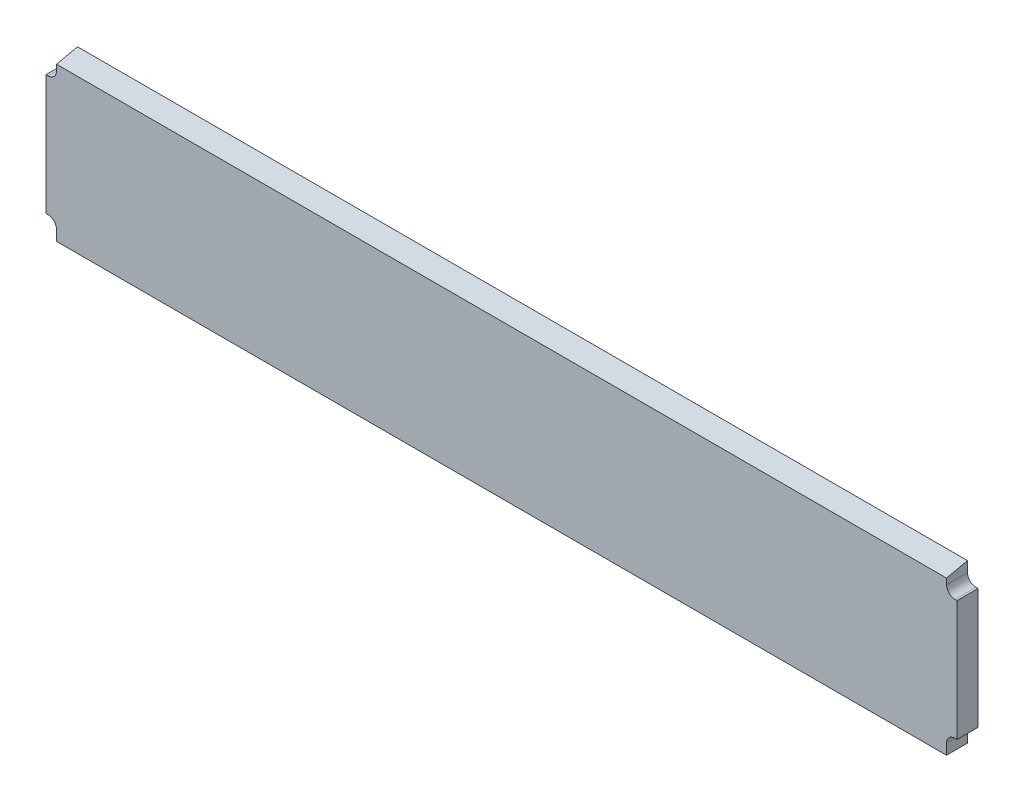
ISO-10303-21;
HEADER;
FILE_DESCRIPTION(('STEP AP214'),'2;1');
FILE_NAME('part.step','',(''),(''),'','','');
FILE_SCHEMA(('AUTOMOTIVE_DESIGN { 1 0 10303 214 1 1 1 1 }'));
ENDSEC;
DATA;
#1=APPLICATION_CONTEXT('core data for automotive mechanical design processes');
#2=APPLICATION_PROTOCOL_DEFINITION('international standard','automotive_design',2000,#1);
#3=PRODUCT_CONTEXT('',#1,'mechanical');
#4=PRODUCT('Part','Part','',(#3));
#5=PRODUCT_RELATED_PRODUCT_CATEGORY('part','',(#4));
#6=PRODUCT_DEFINITION_FORMATION('','',#4);
#7=PRODUCT_DEFINITION_CONTEXT('part definition',#1,'design');
#8=PRODUCT_DEFINITION('design','',#6,#7);
#9=PRODUCT_DEFINITION_SHAPE('','',#8);
#10=(LENGTH_UNIT() NAMED_UNIT(*) SI_UNIT(.MILLI.,.METRE.));
#11=(NAMED_UNIT(*) PLANE_ANGLE_UNIT() SI_UNIT($,.RADIAN.));
#12=(NAMED_UNIT(*) SI_UNIT($,.STERADIAN.) SOLID_ANGLE_UNIT());
#13=UNCERTAINTY_MEASURE_WITH_UNIT(LENGTH_MEASURE(1.E-05),#10,'distance_accuracy_value','');
#14=(GEOMETRIC_REPRESENTATION_CONTEXT(3) GLOBAL_UNCERTAINTY_ASSIGNED_CONTEXT((#13)) GLOBAL_UNIT_ASSIGNED_CONTEXT((#10,
#11,#12)) REPRESENTATION_CONTEXT('',''));
#15=CARTESIAN_POINT('',(0.,0.,0.));
#16=DIRECTION('',(0.,0.,1.));
#17=DIRECTION('',(1.,0.,0.));
#18=AXIS2_PLACEMENT_3D('',#15,#16,#17);
#19=CARTESIAN_POINT('',(336.55,59.7789,15.875));
#20=DIRECTION('',(1.,0.,0.));
#21=DIRECTION('',(0.,0.,-1.));
#22=AXIS2_PLACEMENT_3D('',#19,#20,#21);
#23=PLANE('',#22);
#24=DIRECTION('',(0.,0.216439613938096,-0.976296007119935));
#25=VECTOR('',#24,1.);
#26=CARTESIAN_POINT('',(336.55,56.4243675474332,15.1313180596035));
#27=LINE('',#26,#25);
#28=CARTESIAN_POINT('',(336.55,56.2594972305434,15.875));
#29=VERTEX_POINT('',#28);
#30=CARTESIAN_POINT('',(336.55,59.7789,0.));
#31=VERTEX_POINT('',#30);
#32=EDGE_CURVE('E151',#29,#31,#27,.T.);
#33=ORIENTED_EDGE('',*,*,#32,.F.);
#34=DIRECTION('',(0.,-1.,0.));
#35=VECTOR('',#34,1.);
#36=CARTESIAN_POINT('',(336.55,59.7789,15.875));
#37=LINE('',#36,#35);
#38=CARTESIAN_POINT('',(336.55,51.8414,15.875));
#39=VERTEX_POINT('',#38);
#40=EDGE_CURVE('E154',#29,#39,#37,.T.);
#41=ORIENTED_EDGE('',*,*,#40,.T.);
#42=DIRECTION('',(0.,0.,-1.));
#43=VECTOR('',#42,1.);
#44=CARTESIAN_POINT('',(336.55,51.8414,15.875));
#45=LINE('',#44,#43);
#46=CARTESIAN_POINT('',(336.55,51.8414,0.));
#47=VERTEX_POINT('',#46);
#48=EDGE_CURVE('E206',#39,#47,#45,.T.);
#49=ORIENTED_EDGE('',*,*,#48,.T.);
#50=DIRECTION('',(0.,-1.,0.));
#51=VECTOR('',#50,1.);
#52=CARTESIAN_POINT('',(336.55,59.7789,0.));
#53=LINE('',#52,#51);
#54=EDGE_CURVE('E287',#31,#47,#53,.T.);
#55=ORIENTED_EDGE('',*,*,#54,.F.);
#56=EDGE_LOOP('',(#33,#41,#49,#55));
#57=FACE_BOUND('',#56,.T.);
#58=ADVANCED_FACE('F32',(#57),#23,.T.);
#59=CARTESIAN_POINT('',(-336.55,59.7789,15.875));
#60=DIRECTION('',(1.,0.,0.));
#61=DIRECTION('',(0.,0.,-1.));
#62=AXIS2_PLACEMENT_3D('',#59,#60,#61);
#63=PLANE('',#62);
#64=DIRECTION('',(0.,-1.,0.));
#65=VECTOR('',#64,1.);
#66=CARTESIAN_POINT('',(-336.55,59.7789,15.875));
#67=LINE('',#66,#65);
#68=CARTESIAN_POINT('',(-336.55,56.2594972305434,15.875));
#69=VERTEX_POINT('',#68);
#70=CARTESIAN_POINT('',(-336.55,51.8414,15.875));
#71=VERTEX_POINT('',#70);
#72=EDGE_CURVE('E163',#69,#71,#67,.T.);
#73=ORIENTED_EDGE('',*,*,#72,.F.);
#74=DIRECTION('',(0.,0.216439613938096,-0.976296007119935));
#75=VECTOR('',#74,1.);
#76=CARTESIAN_POINT('',(-336.55,56.4243675474332,15.1313180596035));
#77=LINE('',#76,#75);
#78=CARTESIAN_POINT('',(-336.55,59.7789,0.));
#79=VERTEX_POINT('',#78);
#80=EDGE_CURVE('E148',#69,#79,#77,.T.);
#81=ORIENTED_EDGE('',*,*,#80,.T.);
#82=DIRECTION('',(0.,-1.,0.));
#83=VECTOR('',#82,1.);
#84=CARTESIAN_POINT('',(-336.55,59.7789,0.));
#85=LINE('',#84,#83);
#86=CARTESIAN_POINT('',(-336.55,51.8414,0.));
#87=VERTEX_POINT('',#86);
#88=EDGE_CURVE('E155',#79,#87,#85,.T.);
#89=ORIENTED_EDGE('',*,*,#88,.T.);
#90=DIRECTION('',(0.,0.,-1.));
#91=VECTOR('',#90,1.);
#92=CARTESIAN_POINT('',(-336.55,51.8414,15.875));
#93=LINE('',#92,#91);
#94=EDGE_CURVE('E199',#87,#71,#93,.F.);
#95=ORIENTED_EDGE('',*,*,#94,.T.);
#96=EDGE_LOOP('',(#73,#81,#89,#95));
#97=FACE_BOUND('',#96,.T.);
#98=ADVANCED_FACE('F160',(#97),#63,.F.);
#99=CARTESIAN_POINT('',(-336.55,45.4914,15.875));
#100=DIRECTION('',(0.,-1.,0.));
#101=DIRECTION('',(0.,0.,-1.));
#102=AXIS2_PLACEMENT_3D('',#99,#100,#101);
#103=PLANE('',#102);
#104=DIRECTION('',(-1.,0.,0.));
#105=VECTOR('',#104,1.);
#106=CARTESIAN_POINT('',(-336.55,45.4914,15.875));
#107=LINE('',#106,#105);
#108=CARTESIAN_POINT('',(-342.9,45.4914,15.875));
#109=VERTEX_POINT('',#108);
#110=CARTESIAN_POINT('',(-344.4875,45.4914,15.875));
#111=VERTEX_POINT('',#110);
#112=EDGE_CURVE('E281',#109,#111,#107,.T.);
#113=ORIENTED_EDGE('',*,*,#112,.F.);
#114=DIRECTION('',(0.,0.,-1.));
#115=VECTOR('',#114,1.);
#116=CARTESIAN_POINT('',(-342.9,45.4914,0.));
#117=LINE('',#116,#115);
#118=CARTESIAN_POINT('',(-342.9,45.4914,0.));
#119=VERTEX_POINT('',#118);
#120=EDGE_CURVE('E196',#109,#119,#117,.T.);
#121=ORIENTED_EDGE('',*,*,#120,.T.);
#122=DIRECTION('',(-1.,0.,0.));
#123=VECTOR('',#122,1.);
#124=CARTESIAN_POINT('',(-336.55,45.4914,0.));
#125=LINE('',#124,#123);
#126=CARTESIAN_POINT('',(-344.4875,45.4914,0.));
#127=VERTEX_POINT('',#126);
#128=EDGE_CURVE('E169',#119,#127,#125,.T.);
#129=ORIENTED_EDGE('',*,*,#128,.T.);
#130=DIRECTION('',(0.,0.,-1.));
#131=VECTOR('',#130,1.);
#132=CARTESIAN_POINT('',(-344.4875,45.4914,15.875));
#133=LINE('',#132,#131);
#134=EDGE_CURVE('E175',#111,#127,#133,.T.);
#135=ORIENTED_EDGE('',*,*,#134,.F.);
#136=EDGE_LOOP('',(#113,#121,#129,#135));
#137=FACE_BOUND('',#136,.T.);
#138=ADVANCED_FACE('F322',(#137),#103,.F.);
#139=CARTESIAN_POINT('',(-344.4875,45.4914,15.875));
#140=DIRECTION('',(1.,0.,0.));
#141=DIRECTION('',(0.,0.,-1.));
#142=AXIS2_PLACEMENT_3D('',#139,#140,#141);
#143=PLANE('',#142);
#144=DIRECTION('',(0.,-1.,0.));
#145=VECTOR('',#144,1.);
#146=CARTESIAN_POINT('',(-344.4875,45.4914,0.));
#147=LINE('',#146,#145);
#148=CARTESIAN_POINT('',(-344.4875,-45.4914,0.));
#149=VERTEX_POINT('',#148);
#150=EDGE_CURVE('E171',#127,#149,#147,.T.);
#151=ORIENTED_EDGE('',*,*,#150,.T.);
#152=DIRECTION('',(0.,0.,-1.));
#153=VECTOR('',#152,1.);
#154=CARTESIAN_POINT('',(-344.4875,-45.4914,15.875));
#155=LINE('',#154,#153);
#156=CARTESIAN_POINT('',(-344.4875,-45.4914,15.875));
#157=VERTEX_POINT('',#156);
#158=EDGE_CURVE('E179',#157,#149,#155,.T.);
#159=ORIENTED_EDGE('',*,*,#158,.F.);
#160=DIRECTION('',(0.,-1.,0.));
#161=VECTOR('',#160,1.);
#162=CARTESIAN_POINT('',(-344.4875,45.4914,15.875));
#163=LINE('',#162,#161);
#164=EDGE_CURVE('E277',#111,#157,#163,.T.);
#165=ORIENTED_EDGE('',*,*,#164,.F.);
#166=ORIENTED_EDGE('',*,*,#134,.T.);
#167=EDGE_LOOP('',(#151,#159,#165,#166));
#168=FACE_BOUND('',#167,.T.);
#169=ADVANCED_FACE('F265',(#168),#143,.F.);
#170=CARTESIAN_POINT('',(-336.55,-45.4914,15.875));
#171=DIRECTION('',(0.,-1.,0.));
#172=DIRECTION('',(0.,0.,-1.));
#173=AXIS2_PLACEMENT_3D('',#170,#171,#172);
#174=PLANE('',#173);
#175=DIRECTION('',(-1.,0.,0.));
#176=VECTOR('',#175,1.);
#177=CARTESIAN_POINT('',(-336.55,-45.4914,0.));
#178=LINE('',#177,#176);
#179=CARTESIAN_POINT('',(-342.9,-45.4914,0.));
#180=VERTEX_POINT('',#179);
#181=EDGE_CURVE('E260',#180,#149,#178,.T.);
#182=ORIENTED_EDGE('',*,*,#181,.F.);
#183=DIRECTION('',(0.,0.,-1.));
#184=VECTOR('',#183,1.);
#185=CARTESIAN_POINT('',(-342.9,-45.4914,15.875));
#186=LINE('',#185,#184);
#187=CARTESIAN_POINT('',(-342.9,-45.4914,15.875));
#188=VERTEX_POINT('',#187);
#189=EDGE_CURVE('E194',#180,#188,#186,.F.);
#190=ORIENTED_EDGE('',*,*,#189,.T.);
#191=DIRECTION('',(-1.,0.,0.));
#192=VECTOR('',#191,1.);
#193=CARTESIAN_POINT('',(-336.55,-45.4914,15.875));
#194=LINE('',#193,#192);
#195=EDGE_CURVE('E274',#188,#157,#194,.T.);
#196=ORIENTED_EDGE('',*,*,#195,.T.);
#197=ORIENTED_EDGE('',*,*,#158,.T.);
#198=EDGE_LOOP('',(#182,#190,#196,#197));
#199=FACE_BOUND('',#198,.T.);
#200=ADVANCED_FACE('F272',(#199),#174,.T.);
#201=CARTESIAN_POINT('',(-336.55,-45.4914,15.875));
#202=DIRECTION('',(1.,0.,0.));
#203=DIRECTION('',(0.,0.,-1.));
#204=AXIS2_PLACEMENT_3D('',#201,#202,#203);
#205=PLANE('',#204);
#206=DIRECTION('',(0.,-1.,0.));
#207=VECTOR('',#206,1.);
#208=CARTESIAN_POINT('',(-336.55,-45.4914,15.875));
#209=LINE('',#208,#207);
#210=CARTESIAN_POINT('',(-336.55,-51.8414,15.875));
#211=VERTEX_POINT('',#210);
#212=CARTESIAN_POINT('',(-336.55,-59.7789,15.875));
#213=VERTEX_POINT('',#212);
#214=EDGE_CURVE('E278',#211,#213,#209,.T.);
#215=ORIENTED_EDGE('',*,*,#214,.F.);
#216=DIRECTION('',(0.,0.,-1.));
#217=VECTOR('',#216,1.);
#218=CARTESIAN_POINT('',(-336.55,-51.8414,15.875));
#219=LINE('',#218,#217);
#220=CARTESIAN_POINT('',(-336.55,-51.8414,0.));
#221=VERTEX_POINT('',#220);
#222=EDGE_CURVE('E178',#211,#221,#219,.T.);
#223=ORIENTED_EDGE('',*,*,#222,.T.);
#224=DIRECTION('',(0.,-1.,0.));
#225=VECTOR('',#224,1.);
#226=CARTESIAN_POINT('',(-336.55,-45.4914,0.));
#227=LINE('',#226,#225);
#228=CARTESIAN_POINT('',(-336.55,-59.7789,0.));
#229=VERTEX_POINT('',#228);
#230=EDGE_CURVE('E253',#221,#229,#227,.T.);
#231=ORIENTED_EDGE('',*,*,#230,.T.);
#232=DIRECTION('',(0.,0.,-1.));
#233=VECTOR('',#232,1.);
#234=CARTESIAN_POINT('',(-336.55,-59.7789,15.875));
#235=LINE('',#234,#233);
#236=EDGE_CURVE('E182',#213,#229,#235,.T.);
#237=ORIENTED_EDGE('',*,*,#236,.F.);
#238=EDGE_LOOP('',(#215,#223,#231,#237));
#239=FACE_BOUND('',#238,.T.);
#240=ADVANCED_FACE('F305',(#239),#205,.F.);
#241=CARTESIAN_POINT('',(336.55,-59.7789,15.875));
#242=DIRECTION('',(0.,-1.,0.));
#243=DIRECTION('',(0.,0.,-1.));
#244=AXIS2_PLACEMENT_3D('',#241,#242,#243);
#245=PLANE('',#244);
#246=DIRECTION('',(-1.,0.,0.));
#247=VECTOR('',#246,1.);
#248=CARTESIAN_POINT('',(336.55,-59.7789,0.));
#249=LINE('',#248,#247);
#250=CARTESIAN_POINT('',(336.55,-59.7789,0.));
#251=VERTEX_POINT('',#250);
#252=EDGE_CURVE('E251',#251,#229,#249,.T.);
#253=ORIENTED_EDGE('',*,*,#252,.F.);
#254=DIRECTION('',(0.,0.,-1.));
#255=VECTOR('',#254,1.);
#256=CARTESIAN_POINT('',(336.55,-59.7789,15.875));
#257=LINE('',#256,#255);
#258=CARTESIAN_POINT('',(336.55,-59.7789,15.875));
#259=VERTEX_POINT('',#258);
#260=EDGE_CURVE('E185',#259,#251,#257,.T.);
#261=ORIENTED_EDGE('',*,*,#260,.F.);
#262=DIRECTION('',(-1.,0.,0.));
#263=VECTOR('',#262,1.);
#264=CARTESIAN_POINT('',(336.55,-59.7789,15.875));
#265=LINE('',#264,#263);
#266=EDGE_CURVE('E299',#259,#213,#265,.T.);
#267=ORIENTED_EDGE('',*,*,#266,.T.);
#268=ORIENTED_EDGE('',*,*,#236,.T.);
#269=EDGE_LOOP('',(#253,#261,#267,#268));
#270=FACE_BOUND('',#269,.T.);
#271=ADVANCED_FACE('F307',(#270),#245,.T.);
#272=CARTESIAN_POINT('',(336.55,-45.4914,15.875));
#273=DIRECTION('',(1.,0.,0.));
#274=DIRECTION('',(0.,0.,-1.));
#275=AXIS2_PLACEMENT_3D('',#272,#273,#274);
#276=PLANE('',#275);
#277=DIRECTION('',(0.,-1.,0.));
#278=VECTOR('',#277,1.);
#279=CARTESIAN_POINT('',(336.55,-45.4914,0.));
#280=LINE('',#279,#278);
#281=CARTESIAN_POINT('',(336.55,-51.8414,0.));
#282=VERTEX_POINT('',#281);
#283=EDGE_CURVE('E244',#282,#251,#280,.T.);
#284=ORIENTED_EDGE('',*,*,#283,.F.);
#285=DIRECTION('',(0.,0.,-1.));
#286=VECTOR('',#285,1.);
#287=CARTESIAN_POINT('',(336.55,-51.8414,15.875));
#288=LINE('',#287,#286);
#289=CARTESIAN_POINT('',(336.55,-51.8414,15.875));
#290=VERTEX_POINT('',#289);
#291=EDGE_CURVE('E204',#282,#290,#288,.F.);
#292=ORIENTED_EDGE('',*,*,#291,.T.);
#293=DIRECTION('',(0.,-1.,0.));
#294=VECTOR('',#293,1.);
#295=CARTESIAN_POINT('',(336.55,-45.4914,15.875));
#296=LINE('',#295,#294);
#297=EDGE_CURVE('E231',#290,#259,#296,.T.);
#298=ORIENTED_EDGE('',*,*,#297,.T.);
#299=ORIENTED_EDGE('',*,*,#260,.T.);
#300=EDGE_LOOP('',(#284,#292,#298,#299));
#301=FACE_BOUND('',#300,.T.);
#302=ADVANCED_FACE('F248',(#301),#276,.T.);
#303=CARTESIAN_POINT('',(344.4875,-45.4914,15.875));
#304=DIRECTION('',(0.,-1.,0.));
#305=DIRECTION('',(0.,0.,-1.));
#306=AXIS2_PLACEMENT_3D('',#303,#304,#305);
#307=PLANE('',#306);
#308=DIRECTION('',(-1.,0.,0.));
#309=VECTOR('',#308,1.);
#310=CARTESIAN_POINT('',(344.4875,-45.4914,15.875));
#311=LINE('',#310,#309);
#312=CARTESIAN_POINT('',(344.4875,-45.4914,15.875));
#313=VERTEX_POINT('',#312);
#314=CARTESIAN_POINT('',(342.9,-45.4914,15.875));
#315=VERTEX_POINT('',#314);
#316=EDGE_CURVE('E228',#313,#315,#311,.T.);
#317=ORIENTED_EDGE('',*,*,#316,.T.);
#318=DIRECTION('',(0.,0.,-1.));
#319=VECTOR('',#318,1.);
#320=CARTESIAN_POINT('',(342.9,-45.4914,0.));
#321=LINE('',#320,#319);
#322=CARTESIAN_POINT('',(342.9,-45.4914,0.));
#323=VERTEX_POINT('',#322);
#324=EDGE_CURVE('E201',#315,#323,#321,.T.);
#325=ORIENTED_EDGE('',*,*,#324,.T.);
#326=DIRECTION('',(-1.,0.,0.));
#327=VECTOR('',#326,1.);
#328=CARTESIAN_POINT('',(344.4875,-45.4914,0.));
#329=LINE('',#328,#327);
#330=CARTESIAN_POINT('',(344.4875,-45.4914,0.));
#331=VERTEX_POINT('',#330);
#332=EDGE_CURVE('E246',#331,#323,#329,.T.);
#333=ORIENTED_EDGE('',*,*,#332,.F.);
#334=DIRECTION('',(0.,0.,-1.));
#335=VECTOR('',#334,1.);
#336=CARTESIAN_POINT('',(344.4875,-45.4914,15.875));
#337=LINE('',#336,#335);
#338=EDGE_CURVE('E188',#313,#331,#337,.T.);
#339=ORIENTED_EDGE('',*,*,#338,.F.);
#340=EDGE_LOOP('',(#317,#325,#333,#339));
#341=FACE_BOUND('',#340,.T.);
#342=ADVANCED_FACE('F236',(#341),#307,.T.);
#343=CARTESIAN_POINT('',(344.4875,45.4914,15.875));
#344=DIRECTION('',(1.,0.,0.));
#345=DIRECTION('',(0.,0.,-1.));
#346=AXIS2_PLACEMENT_3D('',#343,#344,#345);
#347=PLANE('',#346);
#348=DIRECTION('',(0.,-1.,0.));
#349=VECTOR('',#348,1.);
#350=CARTESIAN_POINT('',(344.4875,45.4914,0.));
#351=LINE('',#350,#349);
#352=CARTESIAN_POINT('',(344.4875,45.4914,0.));
#353=VERTEX_POINT('',#352);
#354=EDGE_CURVE('E255',#353,#331,#351,.T.);
#355=ORIENTED_EDGE('',*,*,#354,.F.);
#356=DIRECTION('',(0.,0.,-1.));
#357=VECTOR('',#356,1.);
#358=CARTESIAN_POINT('',(344.4875,45.4914,15.875));
#359=LINE('',#358,#357);
#360=CARTESIAN_POINT('',(344.4875,45.4914,15.875));
#361=VERTEX_POINT('',#360);
#362=EDGE_CURVE('E190',#361,#353,#359,.T.);
#363=ORIENTED_EDGE('',*,*,#362,.F.);
#364=DIRECTION('',(0.,-1.,0.));
#365=VECTOR('',#364,1.);
#366=CARTESIAN_POINT('',(344.4875,45.4914,15.875));
#367=LINE('',#366,#365);
#368=EDGE_CURVE('E239',#361,#313,#367,.T.);
#369=ORIENTED_EDGE('',*,*,#368,.T.);
#370=ORIENTED_EDGE('',*,*,#338,.T.);
#371=EDGE_LOOP('',(#355,#363,#369,#370));
#372=FACE_BOUND('',#371,.T.);
#373=ADVANCED_FACE('F292',(#372),#347,.T.);
#374=CARTESIAN_POINT('',(344.4875,45.4914,15.875));
#375=DIRECTION('',(0.,-1.,0.));
#376=DIRECTION('',(0.,0.,-1.));
#377=AXIS2_PLACEMENT_3D('',#374,#375,#376);
#378=PLANE('',#377);
#379=DIRECTION('',(-1.,0.,0.));
#380=VECTOR('',#379,1.);
#381=CARTESIAN_POINT('',(344.4875,45.4914,0.));
#382=LINE('',#381,#380);
#383=CARTESIAN_POINT('',(342.9,45.4914,0.));
#384=VERTEX_POINT('',#383);
#385=EDGE_CURVE('E289',#353,#384,#382,.T.);
#386=ORIENTED_EDGE('',*,*,#385,.T.);
#387=DIRECTION('',(0.,0.,-1.));
#388=VECTOR('',#387,1.);
#389=CARTESIAN_POINT('',(342.9,45.4914,15.875));
#390=LINE('',#389,#388);
#391=CARTESIAN_POINT('',(342.9,45.4914,15.875));
#392=VERTEX_POINT('',#391);
#393=EDGE_CURVE('E47',#384,#392,#390,.F.);
#394=ORIENTED_EDGE('',*,*,#393,.T.);
#395=DIRECTION('',(-1.,0.,0.));
#396=VECTOR('',#395,1.);
#397=CARTESIAN_POINT('',(344.4875,45.4914,15.875));
#398=LINE('',#397,#396);
#399=EDGE_CURVE('E293',#361,#392,#398,.T.);
#400=ORIENTED_EDGE('',*,*,#399,.F.);
#401=ORIENTED_EDGE('',*,*,#362,.T.);
#402=EDGE_LOOP('',(#386,#394,#400,#401));
#403=FACE_BOUND('',#402,.T.);
#404=ADVANCED_FACE('F326',(#403),#378,.F.);
#405=CARTESIAN_POINT('',(0.,0.,15.875));
#406=DIRECTION('',(0.,0.,-1.));
#407=DIRECTION('',(-1.,0.,0.));
#408=AXIS2_PLACEMENT_3D('',#405,#406,#407);
#409=PLANE('',#408);
#410=ORIENTED_EDGE('',*,*,#40,.F.);
#411=DIRECTION('',(1.,0.,0.));
#412=VECTOR('',#411,1.);
#413=CARTESIAN_POINT('',(-344.4875,56.2594972305434,15.875));
#414=LINE('',#413,#412);
#415=EDGE_CURVE('E164',#69,#29,#414,.T.);
#416=ORIENTED_EDGE('',*,*,#415,.F.);
#417=ORIENTED_EDGE('',*,*,#72,.T.);
#418=CARTESIAN_POINT('',(-342.9,51.8414,15.875));
#419=DIRECTION('',(0.,0.,-1.));
#420=DIRECTION('',(-1.,0.,0.));
#421=AXIS2_PLACEMENT_3D('',#418,#419,#420);
#422=CIRCLE('',#421,6.35);
#423=EDGE_CURVE('E215',#71,#109,#422,.T.);
#424=ORIENTED_EDGE('',*,*,#423,.T.);
#425=ORIENTED_EDGE('',*,*,#112,.T.);
#426=ORIENTED_EDGE('',*,*,#164,.T.);
#427=ORIENTED_EDGE('',*,*,#195,.F.);
#428=CARTESIAN_POINT('',(-342.9,-51.8414,15.875));
#429=DIRECTION('',(0.,0.,-1.));
#430=DIRECTION('',(-1.,0.,0.));
#431=AXIS2_PLACEMENT_3D('',#428,#429,#430);
#432=CIRCLE('',#431,6.35);
#433=EDGE_CURVE('E212',#188,#211,#432,.T.);
#434=ORIENTED_EDGE('',*,*,#433,.T.);
#435=ORIENTED_EDGE('',*,*,#214,.T.);
#436=ORIENTED_EDGE('',*,*,#266,.F.);
#437=ORIENTED_EDGE('',*,*,#297,.F.);
#438=CARTESIAN_POINT('',(342.9,-51.8414,15.875));
#439=DIRECTION('',(0.,0.,-1.));
#440=DIRECTION('',(-1.,0.,0.));
#441=AXIS2_PLACEMENT_3D('',#438,#439,#440);
#442=CIRCLE('',#441,6.35);
#443=EDGE_CURVE('E219',#290,#315,#442,.T.);
#444=ORIENTED_EDGE('',*,*,#443,.T.);
#445=ORIENTED_EDGE('',*,*,#316,.F.);
#446=ORIENTED_EDGE('',*,*,#368,.F.);
#447=ORIENTED_EDGE('',*,*,#399,.T.);
#448=CARTESIAN_POINT('',(342.9,51.8414,15.875));
#449=DIRECTION('',(0.,0.,-1.));
#450=DIRECTION('',(-1.,0.,0.));
#451=AXIS2_PLACEMENT_3D('',#448,#449,#450);
#452=CIRCLE('',#451,6.35);
#453=EDGE_CURVE('E11',#392,#39,#452,.T.);
#454=ORIENTED_EDGE('',*,*,#453,.T.);
#455=EDGE_LOOP('',(#410,#416,#417,#424,#425,#426,#427,#434,#435,#436,#437,#444,#445,#446,#447,#454));
#456=FACE_BOUND('',#455,.T.);
#457=ADVANCED_FACE('F226',(#456),#409,.F.);
#458=CARTESIAN_POINT('',(0.,0.,0.));
#459=DIRECTION('',(0.,0.,-1.));
#460=DIRECTION('',(-1.,0.,0.));
#461=AXIS2_PLACEMENT_3D('',#458,#459,#460);
#462=PLANE('',#461);
#463=ORIENTED_EDGE('',*,*,#54,.T.);
#464=CARTESIAN_POINT('',(342.9,51.8414,0.));
#465=DIRECTION('',(0.,0.,-1.));
#466=DIRECTION('',(-1.,0.,0.));
#467=AXIS2_PLACEMENT_3D('',#464,#465,#466);
#468=CIRCLE('',#467,6.35);
#469=EDGE_CURVE('E40',#47,#384,#468,.F.);
#470=ORIENTED_EDGE('',*,*,#469,.T.);
#471=ORIENTED_EDGE('',*,*,#385,.F.);
#472=ORIENTED_EDGE('',*,*,#354,.T.);
#473=ORIENTED_EDGE('',*,*,#332,.T.);
#474=CARTESIAN_POINT('',(342.9,-51.8414,0.));
#475=DIRECTION('',(0.,0.,-1.));
#476=DIRECTION('',(-1.,0.,0.));
#477=AXIS2_PLACEMENT_3D('',#474,#475,#476);
#478=CIRCLE('',#477,6.35);
#479=EDGE_CURVE('E217',#323,#282,#478,.F.);
#480=ORIENTED_EDGE('',*,*,#479,.T.);
#481=ORIENTED_EDGE('',*,*,#283,.T.);
#482=ORIENTED_EDGE('',*,*,#252,.T.);
#483=ORIENTED_EDGE('',*,*,#230,.F.);
#484=CARTESIAN_POINT('',(-342.9,-51.8414,0.));
#485=DIRECTION('',(0.,0.,-1.));
#486=DIRECTION('',(-1.,0.,0.));
#487=AXIS2_PLACEMENT_3D('',#484,#485,#486);
#488=CIRCLE('',#487,6.35);
#489=EDGE_CURVE('E210',#221,#180,#488,.F.);
#490=ORIENTED_EDGE('',*,*,#489,.T.);
#491=ORIENTED_EDGE('',*,*,#181,.T.);
#492=ORIENTED_EDGE('',*,*,#150,.F.);
#493=ORIENTED_EDGE('',*,*,#128,.F.);
#494=CARTESIAN_POINT('',(-342.9,51.8414,0.));
#495=DIRECTION('',(0.,0.,-1.));
#496=DIRECTION('',(-1.,0.,0.));
#497=AXIS2_PLACEMENT_3D('',#494,#495,#496);
#498=CIRCLE('',#497,6.35);
#499=EDGE_CURVE('E168',#119,#87,#498,.F.);
#500=ORIENTED_EDGE('',*,*,#499,.T.);
#501=ORIENTED_EDGE('',*,*,#88,.F.);
#502=DIRECTION('',(-1.,0.,0.));
#503=VECTOR('',#502,1.);
#504=CARTESIAN_POINT('',(336.55,59.7789,0.));
#505=LINE('',#504,#503);
#506=EDGE_CURVE('E145',#31,#79,#505,.T.);
#507=ORIENTED_EDGE('',*,*,#506,.F.);
#508=EDGE_LOOP('',(#463,#470,#471,#472,#473,#480,#481,#482,#483,#490,#491,#492,#493,#500,#501,#507));
#509=FACE_BOUND('',#508,.T.);
#510=ADVANCED_FACE('F166',(#509),#462,.T.);
#511=CARTESIAN_POINT('',(-342.9,-51.8414,15.875));
#512=DIRECTION('',(0.,0.,-1.));
#513=DIRECTION('',(-1.,0.,0.));
#514=AXIS2_PLACEMENT_3D('',#511,#512,#513);
#515=CYLINDRICAL_SURFACE('',#514,6.35);
#516=ORIENTED_EDGE('',*,*,#433,.F.);
#517=ORIENTED_EDGE('',*,*,#189,.F.);
#518=ORIENTED_EDGE('',*,*,#489,.F.);
#519=ORIENTED_EDGE('',*,*,#222,.F.);
#520=EDGE_LOOP('',(#516,#517,#518,#519));
#521=FACE_BOUND('',#520,.T.);
#522=ADVANCED_FACE('F328',(#521),#515,.F.);
#523=CARTESIAN_POINT('',(-342.9,51.8414,15.875));
#524=DIRECTION('',(0.,0.,1.));
#525=DIRECTION('',(1.,0.,0.));
#526=AXIS2_PLACEMENT_3D('',#523,#524,#525);
#527=CYLINDRICAL_SURFACE('',#526,6.35);
#528=ORIENTED_EDGE('',*,*,#423,.F.);
#529=ORIENTED_EDGE('',*,*,#94,.F.);
#530=ORIENTED_EDGE('',*,*,#499,.F.);
#531=ORIENTED_EDGE('',*,*,#120,.F.);
#532=EDGE_LOOP('',(#528,#529,#530,#531));
#533=FACE_BOUND('',#532,.T.);
#534=ADVANCED_FACE('F331',(#533),#527,.F.);
#535=CARTESIAN_POINT('',(342.9,-51.8414,15.875));
#536=DIRECTION('',(0.,0.,1.));
#537=DIRECTION('',(1.,0.,0.));
#538=AXIS2_PLACEMENT_3D('',#535,#536,#537);
#539=CYLINDRICAL_SURFACE('',#538,6.35);
#540=ORIENTED_EDGE('',*,*,#443,.F.);
#541=ORIENTED_EDGE('',*,*,#291,.F.);
#542=ORIENTED_EDGE('',*,*,#479,.F.);
#543=ORIENTED_EDGE('',*,*,#324,.F.);
#544=EDGE_LOOP('',(#540,#541,#542,#543));
#545=FACE_BOUND('',#544,.T.);
#546=ADVANCED_FACE('F241',(#545),#539,.F.);
#547=CARTESIAN_POINT('',(342.9,51.8414,15.875));
#548=DIRECTION('',(0.,0.,-1.));
#549=DIRECTION('',(-1.,0.,0.));
#550=AXIS2_PLACEMENT_3D('',#547,#548,#549);
#551=CYLINDRICAL_SURFACE('',#550,6.35);
#552=ORIENTED_EDGE('',*,*,#453,.F.);
#553=ORIENTED_EDGE('',*,*,#393,.F.);
#554=ORIENTED_EDGE('',*,*,#469,.F.);
#555=ORIENTED_EDGE('',*,*,#48,.F.);
#556=EDGE_LOOP('',(#552,#553,#554,#555));
#557=FACE_BOUND('',#556,.T.);
#558=ADVANCED_FACE('F34',(#557),#551,.F.);
#559=CARTESIAN_POINT('',(-344.4875,59.7789,0.));
#560=DIRECTION('',(0.,-0.976296007119935,-0.216439613938096));
#561=DIRECTION('',(0.,0.216439613938096,-0.976296007119935));
#562=AXIS2_PLACEMENT_3D('',#559,#560,#561);
#563=PLANE('',#562);
#564=ORIENTED_EDGE('',*,*,#32,.T.);
#565=ORIENTED_EDGE('',*,*,#506,.T.);
#566=ORIENTED_EDGE('',*,*,#80,.F.);
#567=ORIENTED_EDGE('',*,*,#415,.T.);
#568=EDGE_LOOP('',(#564,#565,#566,#567));
#569=FACE_BOUND('',#568,.T.);
#570=ADVANCED_FACE('F147',(#569),#563,.F.);
#571=CLOSED_SHELL('',(#58,#98,#138,#169,#200,#240,#271,#302,#342,#373,#404,#457,#510,#522,#534,
#546,#558,#570));
#572=MANIFOLD_SOLID_BREP('B2',#571);
#573=ADVANCED_BREP_SHAPE_REPRESENTATION('',(#18,#572),#14);
#574=SHAPE_DEFINITION_REPRESENTATION(#9,#573);
ENDSEC;
END-ISO-10303-21;
